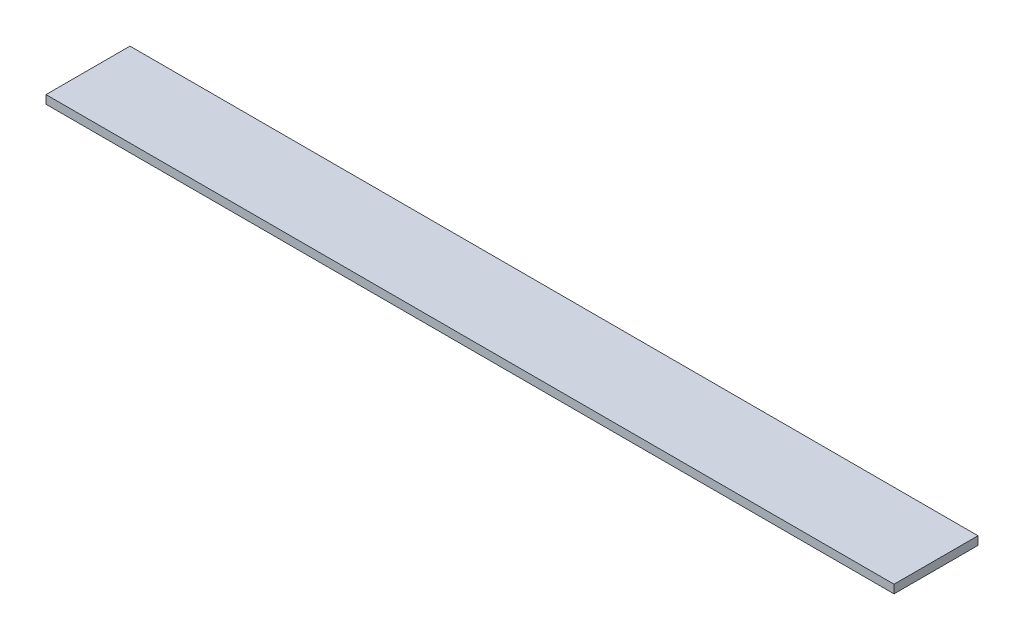
ISO-10303-21;
HEADER;
FILE_DESCRIPTION(('STEP AP214'),'2;1');
FILE_NAME('part.step','',(''),(''),'','','');
FILE_SCHEMA(('AUTOMOTIVE_DESIGN { 1 0 10303 214 1 1 1 1 }'));
ENDSEC;
DATA;
#1=APPLICATION_CONTEXT('core data for automotive mechanical design processes');
#2=APPLICATION_PROTOCOL_DEFINITION('international standard','automotive_design',2000,#1);
#3=PRODUCT_CONTEXT('',#1,'mechanical');
#4=PRODUCT('Part','Part','',(#3));
#5=PRODUCT_RELATED_PRODUCT_CATEGORY('part','',(#4));
#6=PRODUCT_DEFINITION_FORMATION('','',#4);
#7=PRODUCT_DEFINITION_CONTEXT('part definition',#1,'design');
#8=PRODUCT_DEFINITION('design','',#6,#7);
#9=PRODUCT_DEFINITION_SHAPE('','',#8);
#10=(LENGTH_UNIT() NAMED_UNIT(*) SI_UNIT(.MILLI.,.METRE.));
#11=(NAMED_UNIT(*) PLANE_ANGLE_UNIT() SI_UNIT($,.RADIAN.));
#12=(NAMED_UNIT(*) SI_UNIT($,.STERADIAN.) SOLID_ANGLE_UNIT());
#13=UNCERTAINTY_MEASURE_WITH_UNIT(LENGTH_MEASURE(1.E-05),#10,'distance_accuracy_value','');
#14=(GEOMETRIC_REPRESENTATION_CONTEXT(3) GLOBAL_UNCERTAINTY_ASSIGNED_CONTEXT((#13)) GLOBAL_UNIT_ASSIGNED_CONTEXT((#10,
#11,#12)) REPRESENTATION_CONTEXT('',''));
#15=CARTESIAN_POINT('',(0.,0.,0.));
#16=DIRECTION('',(0.,0.,1.));
#17=DIRECTION('',(1.,0.,0.));
#18=AXIS2_PLACEMENT_3D('',#15,#16,#17);
#19=CARTESIAN_POINT('',(-505.,10.,-50.));
#20=DIRECTION('',(1.,0.,0.));
#21=DIRECTION('',(0.,0.,-1.));
#22=AXIS2_PLACEMENT_3D('',#19,#20,#21);
#23=PLANE('',#22);
#24=DIRECTION('',(0.,0.,1.));
#25=VECTOR('',#24,1.);
#26=CARTESIAN_POINT('',(-505.,0.,-50.));
#27=LINE('',#26,#25);
#28=CARTESIAN_POINT('',(-505.,0.,-50.));
#29=VERTEX_POINT('',#28);
#30=CARTESIAN_POINT('',(-505.,0.,50.));
#31=VERTEX_POINT('',#30);
#32=EDGE_CURVE('E98',#29,#31,#27,.T.);
#33=ORIENTED_EDGE('',*,*,#32,.T.);
#34=DIRECTION('',(0.,-1.,0.));
#35=VECTOR('',#34,1.);
#36=CARTESIAN_POINT('',(-505.,10.,50.));
#37=LINE('',#36,#35);
#38=CARTESIAN_POINT('',(-505.,10.,50.));
#39=VERTEX_POINT('',#38);
#40=EDGE_CURVE('E11',#39,#31,#37,.T.);
#41=ORIENTED_EDGE('',*,*,#40,.F.);
#42=DIRECTION('',(0.,0.,1.));
#43=VECTOR('',#42,1.);
#44=CARTESIAN_POINT('',(-505.,10.,-50.));
#45=LINE('',#44,#43);
#46=CARTESIAN_POINT('',(-505.,10.,-50.));
#47=VERTEX_POINT('',#46);
#48=EDGE_CURVE('E86',#47,#39,#45,.T.);
#49=ORIENTED_EDGE('',*,*,#48,.F.);
#50=DIRECTION('',(0.,-1.,0.));
#51=VECTOR('',#50,1.);
#52=CARTESIAN_POINT('',(-505.,10.,-50.));
#53=LINE('',#52,#51);
#54=EDGE_CURVE('E94',#47,#29,#53,.T.);
#55=ORIENTED_EDGE('',*,*,#54,.T.);
#56=EDGE_LOOP('',(#33,#41,#49,#55));
#57=FACE_BOUND('',#56,.T.);
#58=ADVANCED_FACE('F35',(#57),#23,.F.);
#59=CARTESIAN_POINT('',(-505.,10.,50.));
#60=DIRECTION('',(0.,0.,-1.));
#61=DIRECTION('',(-1.,0.,0.));
#62=AXIS2_PLACEMENT_3D('',#59,#60,#61);
#63=PLANE('',#62);
#64=DIRECTION('',(1.,0.,0.));
#65=VECTOR('',#64,1.);
#66=CARTESIAN_POINT('',(-505.,0.,50.));
#67=LINE('',#66,#65);
#68=CARTESIAN_POINT('',(505.,0.,50.));
#69=VERTEX_POINT('',#68);
#70=EDGE_CURVE('E90',#31,#69,#67,.T.);
#71=ORIENTED_EDGE('',*,*,#70,.T.);
#72=DIRECTION('',(0.,-1.,0.));
#73=VECTOR('',#72,1.);
#74=CARTESIAN_POINT('',(505.,10.,50.));
#75=LINE('',#74,#73);
#76=CARTESIAN_POINT('',(505.,10.,50.));
#77=VERTEX_POINT('',#76);
#78=EDGE_CURVE('E43',#77,#69,#75,.T.);
#79=ORIENTED_EDGE('',*,*,#78,.F.);
#80=DIRECTION('',(1.,0.,0.));
#81=VECTOR('',#80,1.);
#82=CARTESIAN_POINT('',(-505.,10.,50.));
#83=LINE('',#82,#81);
#84=EDGE_CURVE('E81',#39,#77,#83,.T.);
#85=ORIENTED_EDGE('',*,*,#84,.F.);
#86=ORIENTED_EDGE('',*,*,#40,.T.);
#87=EDGE_LOOP('',(#71,#79,#85,#86));
#88=FACE_BOUND('',#87,.T.);
#89=ADVANCED_FACE('F89',(#88),#63,.F.);
#90=CARTESIAN_POINT('',(505.,10.,-50.));
#91=DIRECTION('',(-1.,0.,0.));
#92=DIRECTION('',(0.,0.,1.));
#93=AXIS2_PLACEMENT_3D('',#90,#91,#92);
#94=PLANE('',#93);
#95=DIRECTION('',(0.,0.,-1.));
#96=VECTOR('',#95,1.);
#97=CARTESIAN_POINT('',(505.,0.,-50.));
#98=LINE('',#97,#96);
#99=CARTESIAN_POINT('',(505.,0.,-50.));
#100=VERTEX_POINT('',#99);
#101=EDGE_CURVE('E68',#69,#100,#98,.T.);
#102=ORIENTED_EDGE('',*,*,#101,.T.);
#103=DIRECTION('',(0.,-1.,0.));
#104=VECTOR('',#103,1.);
#105=CARTESIAN_POINT('',(505.,10.,-50.));
#106=LINE('',#105,#104);
#107=CARTESIAN_POINT('',(505.,10.,-50.));
#108=VERTEX_POINT('',#107);
#109=EDGE_CURVE('E91',#108,#100,#106,.T.);
#110=ORIENTED_EDGE('',*,*,#109,.F.);
#111=DIRECTION('',(0.,0.,-1.));
#112=VECTOR('',#111,1.);
#113=CARTESIAN_POINT('',(505.,10.,-50.));
#114=LINE('',#113,#112);
#115=EDGE_CURVE('E84',#77,#108,#114,.T.);
#116=ORIENTED_EDGE('',*,*,#115,.F.);
#117=ORIENTED_EDGE('',*,*,#78,.T.);
#118=EDGE_LOOP('',(#102,#110,#116,#117));
#119=FACE_BOUND('',#118,.T.);
#120=ADVANCED_FACE('F92',(#119),#94,.F.);
#121=CARTESIAN_POINT('',(-505.,10.,-50.));
#122=DIRECTION('',(0.,0.,1.));
#123=DIRECTION('',(1.,0.,0.));
#124=AXIS2_PLACEMENT_3D('',#121,#122,#123);
#125=PLANE('',#124);
#126=DIRECTION('',(-1.,0.,0.));
#127=VECTOR('',#126,1.);
#128=CARTESIAN_POINT('',(-505.,0.,-50.));
#129=LINE('',#128,#127);
#130=EDGE_CURVE('E74',#100,#29,#129,.T.);
#131=ORIENTED_EDGE('',*,*,#130,.T.);
#132=ORIENTED_EDGE('',*,*,#54,.F.);
#133=DIRECTION('',(-1.,0.,0.));
#134=VECTOR('',#133,1.);
#135=CARTESIAN_POINT('',(-505.,10.,-50.));
#136=LINE('',#135,#134);
#137=EDGE_CURVE('E51',#108,#47,#136,.T.);
#138=ORIENTED_EDGE('',*,*,#137,.F.);
#139=ORIENTED_EDGE('',*,*,#109,.T.);
#140=EDGE_LOOP('',(#131,#132,#138,#139));
#141=FACE_BOUND('',#140,.T.);
#142=ADVANCED_FACE('F105',(#141),#125,.F.);
#143=CARTESIAN_POINT('',(0.,10.,0.));
#144=DIRECTION('',(0.,1.,0.));
#145=DIRECTION('',(0.,0.,1.));
#146=AXIS2_PLACEMENT_3D('',#143,#144,#145);
#147=PLANE('',#146);
#148=ORIENTED_EDGE('',*,*,#48,.T.);
#149=ORIENTED_EDGE('',*,*,#84,.T.);
#150=ORIENTED_EDGE('',*,*,#115,.T.);
#151=ORIENTED_EDGE('',*,*,#137,.T.);
#152=EDGE_LOOP('',(#148,#149,#150,#151));
#153=FACE_BOUND('',#152,.T.);
#154=ADVANCED_FACE('F82',(#153),#147,.T.);
#155=CARTESIAN_POINT('',(0.,0.,0.));
#156=DIRECTION('',(0.,1.,0.));
#157=DIRECTION('',(0.,0.,1.));
#158=AXIS2_PLACEMENT_3D('',#155,#156,#157);
#159=PLANE('',#158);
#160=ORIENTED_EDGE('',*,*,#32,.F.);
#161=ORIENTED_EDGE('',*,*,#130,.F.);
#162=ORIENTED_EDGE('',*,*,#101,.F.);
#163=ORIENTED_EDGE('',*,*,#70,.F.);
#164=EDGE_LOOP('',(#160,#161,#162,#163));
#165=FACE_BOUND('',#164,.T.);
#166=ADVANCED_FACE('F108',(#165),#159,.F.);
#167=CLOSED_SHELL('',(#58,#89,#120,#142,#154,#166));
#168=MANIFOLD_SOLID_BREP('B2',#167);
#169=ADVANCED_BREP_SHAPE_REPRESENTATION('',(#18,#168),#14);
#170=SHAPE_DEFINITION_REPRESENTATION(#9,#169);
ENDSEC;
END-ISO-10303-21;
